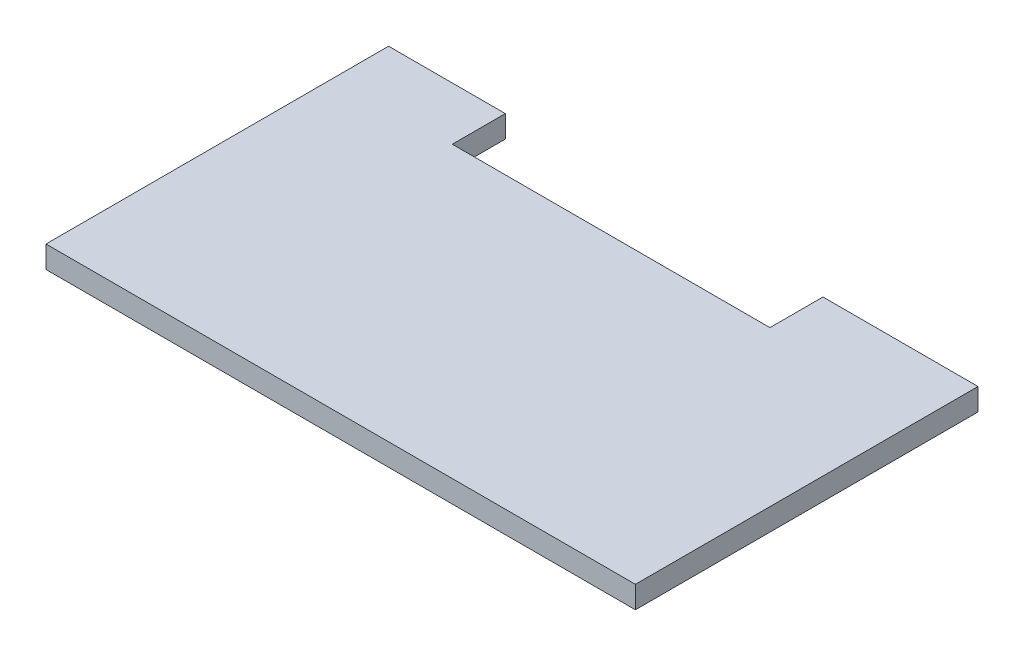
ISO-10303-21;
HEADER;
FILE_DESCRIPTION(('STEP AP214'),'2;1');
FILE_NAME('part.step','',(''),(''),'','','');
FILE_SCHEMA(('AUTOMOTIVE_DESIGN { 1 0 10303 214 1 1 1 1 }'));
ENDSEC;
DATA;
#1=APPLICATION_CONTEXT('core data for automotive mechanical design processes');
#2=APPLICATION_PROTOCOL_DEFINITION('international standard','automotive_design',2000,#1);
#3=PRODUCT_CONTEXT('',#1,'mechanical');
#4=PRODUCT('Part','Part','',(#3));
#5=PRODUCT_RELATED_PRODUCT_CATEGORY('part','',(#4));
#6=PRODUCT_DEFINITION_FORMATION('','',#4);
#7=PRODUCT_DEFINITION_CONTEXT('part definition',#1,'design');
#8=PRODUCT_DEFINITION('design','',#6,#7);
#9=PRODUCT_DEFINITION_SHAPE('','',#8);
#10=(LENGTH_UNIT() NAMED_UNIT(*) SI_UNIT(.MILLI.,.METRE.));
#11=(NAMED_UNIT(*) PLANE_ANGLE_UNIT() SI_UNIT($,.RADIAN.));
#12=(NAMED_UNIT(*) SI_UNIT($,.STERADIAN.) SOLID_ANGLE_UNIT());
#13=UNCERTAINTY_MEASURE_WITH_UNIT(LENGTH_MEASURE(1.E-05),#10,'distance_accuracy_value','');
#14=(GEOMETRIC_REPRESENTATION_CONTEXT(3) GLOBAL_UNCERTAINTY_ASSIGNED_CONTEXT((#13)) GLOBAL_UNIT_ASSIGNED_CONTEXT((#10,
#11,#12)) REPRESENTATION_CONTEXT('',''));
#15=CARTESIAN_POINT('',(0.,0.,0.));
#16=DIRECTION('',(0.,0.,1.));
#17=DIRECTION('',(1.,0.,0.));
#18=AXIS2_PLACEMENT_3D('',#15,#16,#17);
#19=CARTESIAN_POINT('',(0.,-3.,0.));
#20=DIRECTION('',(-1.,0.,0.));
#21=DIRECTION('',(0.,0.,1.));
#22=AXIS2_PLACEMENT_3D('',#19,#20,#21);
#23=PLANE('',#22);
#24=DIRECTION('',(0.,0.,1.));
#25=VECTOR('',#24,1.);
#26=CARTESIAN_POINT('',(0.,0.,0.));
#27=LINE('',#26,#25);
#28=CARTESIAN_POINT('',(0.,0.,-46.5));
#29=VERTEX_POINT('',#28);
#30=CARTESIAN_POINT('',(0.,0.,0.));
#31=VERTEX_POINT('',#30);
#32=EDGE_CURVE('E130',#29,#31,#27,.T.);
#33=ORIENTED_EDGE('',*,*,#32,.F.);
#34=DIRECTION('',(0.,1.,0.));
#35=VECTOR('',#34,1.);
#36=CARTESIAN_POINT('',(0.,-3.,-46.5));
#37=LINE('',#36,#35);
#38=CARTESIAN_POINT('',(0.,-3.,-46.5));
#39=VERTEX_POINT('',#38);
#40=EDGE_CURVE('E11',#39,#29,#37,.T.);
#41=ORIENTED_EDGE('',*,*,#40,.F.);
#42=DIRECTION('',(0.,0.,1.));
#43=VECTOR('',#42,1.);
#44=CARTESIAN_POINT('',(0.,-3.,0.));
#45=LINE('',#44,#43);
#46=CARTESIAN_POINT('',(0.,-3.,0.));
#47=VERTEX_POINT('',#46);
#48=EDGE_CURVE('E150',#39,#47,#45,.T.);
#49=ORIENTED_EDGE('',*,*,#48,.T.);
#50=DIRECTION('',(0.,1.,0.));
#51=VECTOR('',#50,1.);
#52=CARTESIAN_POINT('',(0.,-3.,0.));
#53=LINE('',#52,#51);
#54=EDGE_CURVE('E36',#47,#31,#53,.T.);
#55=ORIENTED_EDGE('',*,*,#54,.T.);
#56=EDGE_LOOP('',(#33,#41,#49,#55));
#57=FACE_BOUND('',#56,.T.);
#58=ADVANCED_FACE('F33',(#57),#23,.T.);
#59=CARTESIAN_POINT('',(0.,-3.,-46.5));
#60=DIRECTION('',(0.,0.,-1.));
#61=DIRECTION('',(-1.,0.,0.));
#62=AXIS2_PLACEMENT_3D('',#59,#60,#61);
#63=PLANE('',#62);
#64=DIRECTION('',(-1.,0.,0.));
#65=VECTOR('',#64,1.);
#66=CARTESIAN_POINT('',(0.,0.,-46.5));
#67=LINE('',#66,#65);
#68=CARTESIAN_POINT('',(15.8431565390477,0.,-46.5));
#69=VERTEX_POINT('',#68);
#70=EDGE_CURVE('E148',#69,#29,#67,.T.);
#71=ORIENTED_EDGE('',*,*,#70,.F.);
#72=DIRECTION('',(0.,1.,0.));
#73=VECTOR('',#72,1.);
#74=CARTESIAN_POINT('',(15.8431565390477,-3.,-46.5));
#75=LINE('',#74,#73);
#76=CARTESIAN_POINT('',(15.8431565390477,-3.,-46.5));
#77=VERTEX_POINT('',#76);
#78=EDGE_CURVE('E42',#77,#69,#75,.T.);
#79=ORIENTED_EDGE('',*,*,#78,.F.);
#80=DIRECTION('',(-1.,0.,0.));
#81=VECTOR('',#80,1.);
#82=CARTESIAN_POINT('',(0.,-3.,-46.5));
#83=LINE('',#82,#81);
#84=EDGE_CURVE('E120',#77,#39,#83,.T.);
#85=ORIENTED_EDGE('',*,*,#84,.T.);
#86=ORIENTED_EDGE('',*,*,#40,.T.);
#87=EDGE_LOOP('',(#71,#79,#85,#86));
#88=FACE_BOUND('',#87,.T.);
#89=ADVANCED_FACE('F162',(#88),#63,.T.);
#90=CARTESIAN_POINT('',(15.8431565390477,-3.,-46.5));
#91=DIRECTION('',(1.,0.,0.));
#92=DIRECTION('',(0.,0.,-1.));
#93=AXIS2_PLACEMENT_3D('',#90,#91,#92);
#94=PLANE('',#93);
#95=DIRECTION('',(0.,0.,-1.));
#96=VECTOR('',#95,1.);
#97=CARTESIAN_POINT('',(15.8431565390477,0.,-46.5));
#98=LINE('',#97,#96);
#99=CARTESIAN_POINT('',(15.8431565390477,0.,-39.3));
#100=VERTEX_POINT('',#99);
#101=EDGE_CURVE('E107',#100,#69,#98,.T.);
#102=ORIENTED_EDGE('',*,*,#101,.F.);
#103=DIRECTION('',(0.,1.,0.));
#104=VECTOR('',#103,1.);
#105=CARTESIAN_POINT('',(15.8431565390477,-3.,-39.3));
#106=LINE('',#105,#104);
#107=CARTESIAN_POINT('',(15.8431565390477,-3.,-39.3));
#108=VERTEX_POINT('',#107);
#109=EDGE_CURVE('E102',#108,#100,#106,.T.);
#110=ORIENTED_EDGE('',*,*,#109,.F.);
#111=DIRECTION('',(0.,0.,-1.));
#112=VECTOR('',#111,1.);
#113=CARTESIAN_POINT('',(15.8431565390477,-3.,-46.5));
#114=LINE('',#113,#112);
#115=EDGE_CURVE('E105',#108,#77,#114,.T.);
#116=ORIENTED_EDGE('',*,*,#115,.T.);
#117=ORIENTED_EDGE('',*,*,#78,.T.);
#118=EDGE_LOOP('',(#102,#110,#116,#117));
#119=FACE_BOUND('',#118,.T.);
#120=ADVANCED_FACE('F104',(#119),#94,.T.);
#121=CARTESIAN_POINT('',(15.8431565390477,-3.,-39.3));
#122=DIRECTION('',(0.,0.,-1.));
#123=DIRECTION('',(-1.,0.,0.));
#124=AXIS2_PLACEMENT_3D('',#121,#122,#123);
#125=PLANE('',#124);
#126=DIRECTION('',(-1.,0.,0.));
#127=VECTOR('',#126,1.);
#128=CARTESIAN_POINT('',(15.8431565390477,0.,-39.3));
#129=LINE('',#128,#127);
#130=CARTESIAN_POINT('',(58.9568434609523,0.,-39.3));
#131=VERTEX_POINT('',#130);
#132=EDGE_CURVE('E145',#131,#100,#129,.T.);
#133=ORIENTED_EDGE('',*,*,#132,.F.);
#134=DIRECTION('',(0.,1.,0.));
#135=VECTOR('',#134,1.);
#136=CARTESIAN_POINT('',(58.9568434609523,-3.,-39.3));
#137=LINE('',#136,#135);
#138=CARTESIAN_POINT('',(58.9568434609523,-3.,-39.3));
#139=VERTEX_POINT('',#138);
#140=EDGE_CURVE('E112',#139,#131,#137,.T.);
#141=ORIENTED_EDGE('',*,*,#140,.F.);
#142=DIRECTION('',(-1.,0.,0.));
#143=VECTOR('',#142,1.);
#144=CARTESIAN_POINT('',(15.8431565390477,-3.,-39.3));
#145=LINE('',#144,#143);
#146=EDGE_CURVE('E118',#139,#108,#145,.T.);
#147=ORIENTED_EDGE('',*,*,#146,.T.);
#148=ORIENTED_EDGE('',*,*,#109,.T.);
#149=EDGE_LOOP('',(#133,#141,#147,#148));
#150=FACE_BOUND('',#149,.T.);
#151=ADVANCED_FACE('F122',(#150),#125,.T.);
#152=CARTESIAN_POINT('',(58.9568434609523,-3.,-39.3));
#153=DIRECTION('',(-1.,0.,0.));
#154=DIRECTION('',(0.,0.,1.));
#155=AXIS2_PLACEMENT_3D('',#152,#153,#154);
#156=PLANE('',#155);
#157=DIRECTION('',(0.,0.,1.));
#158=VECTOR('',#157,1.);
#159=CARTESIAN_POINT('',(58.9568434609523,0.,-39.3));
#160=LINE('',#159,#158);
#161=CARTESIAN_POINT('',(58.9568434609523,0.,-46.5));
#162=VERTEX_POINT('',#161);
#163=EDGE_CURVE('E142',#162,#131,#160,.T.);
#164=ORIENTED_EDGE('',*,*,#163,.F.);
#165=DIRECTION('',(0.,1.,0.));
#166=VECTOR('',#165,1.);
#167=CARTESIAN_POINT('',(58.9568434609523,-3.,-46.5));
#168=LINE('',#167,#166);
#169=CARTESIAN_POINT('',(58.9568434609523,-3.,-46.5));
#170=VERTEX_POINT('',#169);
#171=EDGE_CURVE('E154',#170,#162,#168,.T.);
#172=ORIENTED_EDGE('',*,*,#171,.F.);
#173=DIRECTION('',(0.,0.,1.));
#174=VECTOR('',#173,1.);
#175=CARTESIAN_POINT('',(58.9568434609523,-3.,-39.3));
#176=LINE('',#175,#174);
#177=EDGE_CURVE('E123',#170,#139,#176,.T.);
#178=ORIENTED_EDGE('',*,*,#177,.T.);
#179=ORIENTED_EDGE('',*,*,#140,.T.);
#180=EDGE_LOOP('',(#164,#172,#178,#179));
#181=FACE_BOUND('',#180,.T.);
#182=ADVANCED_FACE('F175',(#181),#156,.T.);
#183=CARTESIAN_POINT('',(58.9568434609523,-3.,-46.5));
#184=DIRECTION('',(0.,0.,-1.));
#185=DIRECTION('',(-1.,0.,0.));
#186=AXIS2_PLACEMENT_3D('',#183,#184,#185);
#187=PLANE('',#186);
#188=DIRECTION('',(-1.,0.,0.));
#189=VECTOR('',#188,1.);
#190=CARTESIAN_POINT('',(58.9568434609523,0.,-46.5));
#191=LINE('',#190,#189);
#192=CARTESIAN_POINT('',(80.,0.,-46.5));
#193=VERTEX_POINT('',#192);
#194=EDGE_CURVE('E139',#193,#162,#191,.T.);
#195=ORIENTED_EDGE('',*,*,#194,.F.);
#196=DIRECTION('',(0.,1.,0.));
#197=VECTOR('',#196,1.);
#198=CARTESIAN_POINT('',(80.,-3.,-46.5));
#199=LINE('',#198,#197);
#200=CARTESIAN_POINT('',(80.,-3.,-46.5));
#201=VERTEX_POINT('',#200);
#202=EDGE_CURVE('E156',#201,#193,#199,.T.);
#203=ORIENTED_EDGE('',*,*,#202,.F.);
#204=DIRECTION('',(-1.,0.,0.));
#205=VECTOR('',#204,1.);
#206=CARTESIAN_POINT('',(58.9568434609523,-3.,-46.5));
#207=LINE('',#206,#205);
#208=EDGE_CURVE('E125',#201,#170,#207,.T.);
#209=ORIENTED_EDGE('',*,*,#208,.T.);
#210=ORIENTED_EDGE('',*,*,#171,.T.);
#211=EDGE_LOOP('',(#195,#203,#209,#210));
#212=FACE_BOUND('',#211,.T.);
#213=ADVANCED_FACE('F178',(#212),#187,.T.);
#214=CARTESIAN_POINT('',(80.,-3.,0.));
#215=DIRECTION('',(1.,0.,0.));
#216=DIRECTION('',(0.,0.,-1.));
#217=AXIS2_PLACEMENT_3D('',#214,#215,#216);
#218=PLANE('',#217);
#219=DIRECTION('',(0.,0.,-1.));
#220=VECTOR('',#219,1.);
#221=CARTESIAN_POINT('',(80.,0.,0.));
#222=LINE('',#221,#220);
#223=CARTESIAN_POINT('',(80.,0.,0.));
#224=VERTEX_POINT('',#223);
#225=EDGE_CURVE('E136',#224,#193,#222,.T.);
#226=ORIENTED_EDGE('',*,*,#225,.F.);
#227=DIRECTION('',(0.,1.,0.));
#228=VECTOR('',#227,1.);
#229=CARTESIAN_POINT('',(80.,-3.,0.));
#230=LINE('',#229,#228);
#231=CARTESIAN_POINT('',(80.,-3.,0.));
#232=VERTEX_POINT('',#231);
#233=EDGE_CURVE('E157',#232,#224,#230,.T.);
#234=ORIENTED_EDGE('',*,*,#233,.F.);
#235=DIRECTION('',(0.,0.,-1.));
#236=VECTOR('',#235,1.);
#237=CARTESIAN_POINT('',(80.,-3.,0.));
#238=LINE('',#237,#236);
#239=EDGE_CURVE('E253',#232,#201,#238,.T.);
#240=ORIENTED_EDGE('',*,*,#239,.T.);
#241=ORIENTED_EDGE('',*,*,#202,.T.);
#242=EDGE_LOOP('',(#226,#234,#240,#241));
#243=FACE_BOUND('',#242,.T.);
#244=ADVANCED_FACE('F182',(#243),#218,.T.);
#245=CARTESIAN_POINT('',(0.,-3.,0.));
#246=DIRECTION('',(0.,0.,1.));
#247=DIRECTION('',(1.,0.,0.));
#248=AXIS2_PLACEMENT_3D('',#245,#246,#247);
#249=PLANE('',#248);
#250=DIRECTION('',(1.,0.,0.));
#251=VECTOR('',#250,1.);
#252=CARTESIAN_POINT('',(0.,0.,0.));
#253=LINE('',#252,#251);
#254=EDGE_CURVE('E133',#31,#224,#253,.T.);
#255=ORIENTED_EDGE('',*,*,#254,.F.);
#256=ORIENTED_EDGE('',*,*,#54,.F.);
#257=DIRECTION('',(1.,0.,0.));
#258=VECTOR('',#257,1.);
#259=CARTESIAN_POINT('',(0.,-3.,0.));
#260=LINE('',#259,#258);
#261=EDGE_CURVE('E254',#47,#232,#260,.T.);
#262=ORIENTED_EDGE('',*,*,#261,.T.);
#263=ORIENTED_EDGE('',*,*,#233,.T.);
#264=EDGE_LOOP('',(#255,#256,#262,#263));
#265=FACE_BOUND('',#264,.T.);
#266=ADVANCED_FACE('F159',(#265),#249,.T.);
#267=CARTESIAN_POINT('',(0.,-3.,0.));
#268=DIRECTION('',(0.,-1.,0.));
#269=DIRECTION('',(0.,0.,-1.));
#270=AXIS2_PLACEMENT_3D('',#267,#268,#269);
#271=PLANE('',#270);
#272=ORIENTED_EDGE('',*,*,#48,.F.);
#273=ORIENTED_EDGE('',*,*,#84,.F.);
#274=ORIENTED_EDGE('',*,*,#115,.F.);
#275=ORIENTED_EDGE('',*,*,#146,.F.);
#276=ORIENTED_EDGE('',*,*,#177,.F.);
#277=ORIENTED_EDGE('',*,*,#208,.F.);
#278=ORIENTED_EDGE('',*,*,#239,.F.);
#279=ORIENTED_EDGE('',*,*,#261,.F.);
#280=EDGE_LOOP('',(#272,#273,#274,#275,#276,#277,#278,#279));
#281=FACE_BOUND('',#280,.T.);
#282=ADVANCED_FACE('F116',(#281),#271,.T.);
#283=CARTESIAN_POINT('',(0.,0.,0.));
#284=DIRECTION('',(0.,-1.,0.));
#285=DIRECTION('',(0.,0.,-1.));
#286=AXIS2_PLACEMENT_3D('',#283,#284,#285);
#287=PLANE('',#286);
#288=ORIENTED_EDGE('',*,*,#32,.T.);
#289=ORIENTED_EDGE('',*,*,#254,.T.);
#290=ORIENTED_EDGE('',*,*,#225,.T.);
#291=ORIENTED_EDGE('',*,*,#194,.T.);
#292=ORIENTED_EDGE('',*,*,#163,.T.);
#293=ORIENTED_EDGE('',*,*,#132,.T.);
#294=ORIENTED_EDGE('',*,*,#101,.T.);
#295=ORIENTED_EDGE('',*,*,#70,.T.);
#296=EDGE_LOOP('',(#288,#289,#290,#291,#292,#293,#294,#295));
#297=FACE_BOUND('',#296,.T.);
#298=ADVANCED_FACE('F161',(#297),#287,.F.);
#299=CLOSED_SHELL('',(#58,#89,#120,#151,#182,#213,#244,#266,#282,#298));
#300=MANIFOLD_SOLID_BREP('B2',#299);
#301=ADVANCED_BREP_SHAPE_REPRESENTATION('',(#18,#300),#14);
#302=SHAPE_DEFINITION_REPRESENTATION(#9,#301);
ENDSEC;
END-ISO-10303-21;
